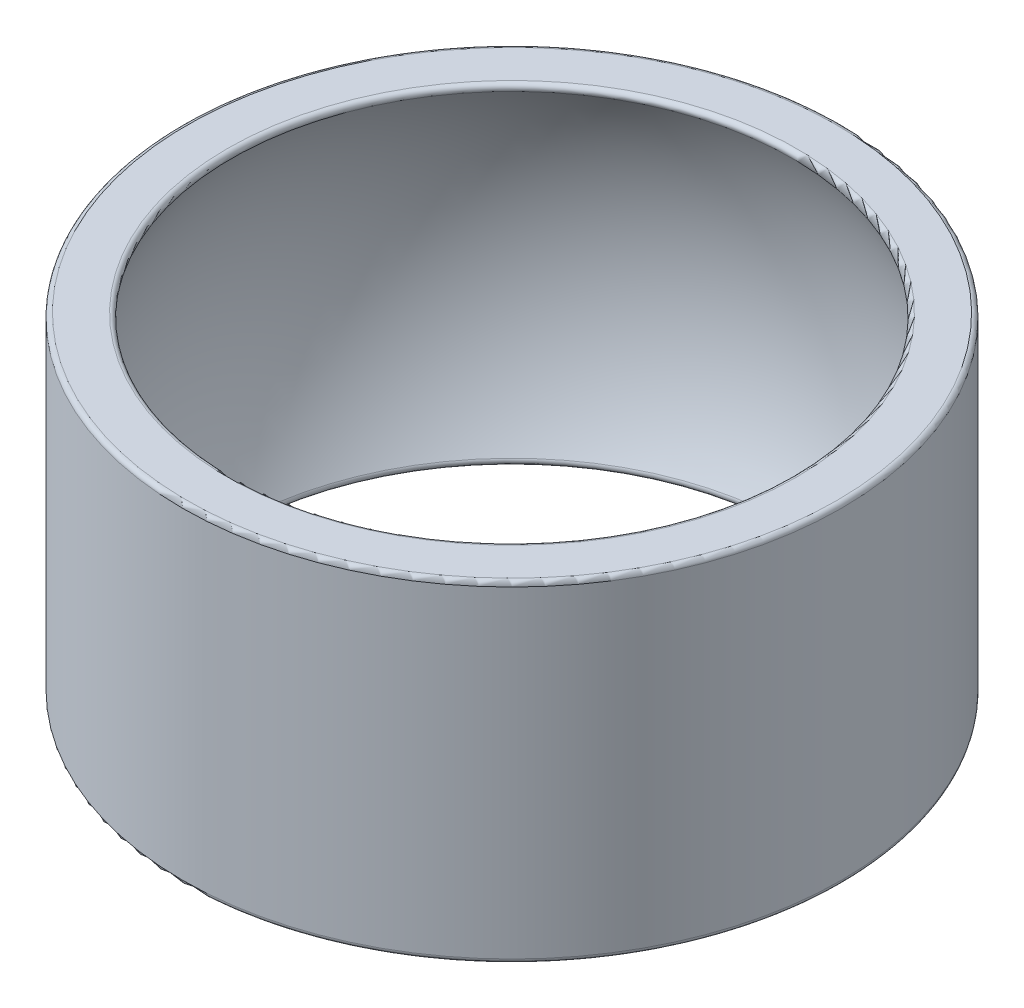
ISO-10303-21;
HEADER;
FILE_DESCRIPTION(('STEP AP214'),'2;1');
FILE_NAME('part.step','',(''),(''),'','','');
FILE_SCHEMA(('AUTOMOTIVE_DESIGN { 1 0 10303 214 1 1 1 1 }'));
ENDSEC;
DATA;
#1=APPLICATION_CONTEXT('core data for automotive mechanical design processes');
#2=APPLICATION_PROTOCOL_DEFINITION('international standard','automotive_design',2000,#1);
#3=PRODUCT_CONTEXT('',#1,'mechanical');
#4=PRODUCT('Part','Part','',(#3));
#5=PRODUCT_RELATED_PRODUCT_CATEGORY('part','',(#4));
#6=PRODUCT_DEFINITION_FORMATION('','',#4);
#7=PRODUCT_DEFINITION_CONTEXT('part definition',#1,'design');
#8=PRODUCT_DEFINITION('design','',#6,#7);
#9=PRODUCT_DEFINITION_SHAPE('','',#8);
#10=(LENGTH_UNIT() NAMED_UNIT(*) SI_UNIT(.MILLI.,.METRE.));
#11=(NAMED_UNIT(*) PLANE_ANGLE_UNIT() SI_UNIT($,.RADIAN.));
#12=(NAMED_UNIT(*) SI_UNIT($,.STERADIAN.) SOLID_ANGLE_UNIT());
#13=UNCERTAINTY_MEASURE_WITH_UNIT(LENGTH_MEASURE(1.E-05),#10,'distance_accuracy_value','');
#14=(GEOMETRIC_REPRESENTATION_CONTEXT(3) GLOBAL_UNCERTAINTY_ASSIGNED_CONTEXT((#13)) GLOBAL_UNIT_ASSIGNED_CONTEXT((#10,
#11,#12)) REPRESENTATION_CONTEXT('',''));
#15=CARTESIAN_POINT('',(0.,0.,0.));
#16=DIRECTION('',(0.,0.,1.));
#17=DIRECTION('',(1.,0.,0.));
#18=AXIS2_PLACEMENT_3D('',#15,#16,#17);
#19=CARTESIAN_POINT('',(0.,11.,0.));
#20=DIRECTION('',(0.,1.,0.));
#21=DIRECTION('',(-1.,0.,0.));
#22=AXIS2_PLACEMENT_3D('',#19,#20,#21);
#23=CYLINDRICAL_SURFACE('',#22,21.8917792789896);
#24=CARTESIAN_POINT('',(0.,-10.7,0.));
#25=DIRECTION('',(0.,1.,0.));
#26=DIRECTION('',(-1.,0.,0.));
#27=AXIS2_PLACEMENT_3D('',#24,#25,#26);
#28=CIRCLE('',#27,21.8917792789896);
#29=CARTESIAN_POINT('',(-21.8917792789896,-10.7,0.));
#30=VERTEX_POINT('',#29);
#31=EDGE_CURVE('E10',#30,#30,#28,.T.);
#32=ORIENTED_EDGE('',*,*,#31,.T.);
#33=EDGE_LOOP('',(#32));
#34=FACE_BOUND('',#33,.T.);
#35=CARTESIAN_POINT('',(0.,10.7,0.));
#36=DIRECTION('',(0.,-1.,0.));
#37=DIRECTION('',(1.,0.,0.));
#38=AXIS2_PLACEMENT_3D('',#35,#36,#37);
#39=CIRCLE('',#38,21.8917792789896);
#40=CARTESIAN_POINT('',(21.8917792789896,10.7,0.));
#41=VERTEX_POINT('',#40);
#42=EDGE_CURVE('E39',#41,#41,#39,.T.);
#43=ORIENTED_EDGE('',*,*,#42,.T.);
#44=EDGE_LOOP('',(#43));
#45=FACE_BOUND('',#44,.T.);
#46=ADVANCED_FACE('F32',(#34,#45),#23,.T.);
#47=CARTESIAN_POINT('',(18.3856091821838,11.,0.));
#48=DIRECTION('',(0.,-1.,0.));
#49=DIRECTION('',(1.,0.,0.));
#50=AXIS2_PLACEMENT_3D('',#47,#48,#49);
#51=PLANE('',#50);
#52=CARTESIAN_POINT('',(0.,11.,0.));
#53=DIRECTION('',(0.,-1.,0.));
#54=DIRECTION('',(1.,0.,0.));
#55=AXIS2_PLACEMENT_3D('',#52,#53,#54);
#56=CIRCLE('',#55,18.9072902606376);
#57=CARTESIAN_POINT('',(18.9072902606376,11.,0.));
#58=VERTEX_POINT('',#57);
#59=EDGE_CURVE('E52',#58,#58,#56,.T.);
#60=ORIENTED_EDGE('',*,*,#59,.T.);
#61=EDGE_LOOP('',(#60));
#62=FACE_BOUND('',#61,.T.);
#63=CARTESIAN_POINT('',(0.,11.,0.));
#64=DIRECTION('',(0.,-1.,0.));
#65=DIRECTION('',(1.,0.,0.));
#66=AXIS2_PLACEMENT_3D('',#63,#64,#65);
#67=CIRCLE('',#66,21.5917792789896);
#68=CARTESIAN_POINT('',(21.5917792789896,11.,0.));
#69=VERTEX_POINT('',#68);
#70=EDGE_CURVE('E55',#69,#69,#67,.F.);
#71=ORIENTED_EDGE('',*,*,#70,.T.);
#72=EDGE_LOOP('',(#71));
#73=FACE_BOUND('',#72,.T.);
#74=ADVANCED_FACE('F88',(#62,#73),#51,.F.);
#75=CARTESIAN_POINT('',(0.,0.,0.));
#76=DIRECTION('',(0.,1.,0.));
#77=DIRECTION('',(1.,0.,0.));
#78=AXIS2_PLACEMENT_3D('',#75,#76,#77);
#79=SPHERICAL_SURFACE('',#78,21.425);
#80=CARTESIAN_POINT('',(0.,10.5522439585731,0.));
#81=DIRECTION('',(0.,-1.,0.));
#82=DIRECTION('',(1.,0.,0.));
#83=AXIS2_PLACEMENT_3D('',#80,#81,#82);
#84=CIRCLE('',#83,18.6461999463365);
#85=CARTESIAN_POINT('',(18.6461999463365,10.5522439585731,0.));
#86=VERTEX_POINT('',#85);
#87=EDGE_CURVE('E58',#86,#86,#84,.F.);
#88=ORIENTED_EDGE('',*,*,#87,.T.);
#89=EDGE_LOOP('',(#88));
#90=FACE_BOUND('',#89,.T.);
#91=CARTESIAN_POINT('',(0.,-10.5522439585731,0.));
#92=DIRECTION('',(0.,1.,0.));
#93=DIRECTION('',(-1.,0.,0.));
#94=AXIS2_PLACEMENT_3D('',#91,#92,#93);
#95=CIRCLE('',#94,18.6461999463365);
#96=CARTESIAN_POINT('',(-18.6461999463365,-10.5522439585731,0.));
#97=VERTEX_POINT('',#96);
#98=EDGE_CURVE('E61',#97,#97,#95,.F.);
#99=ORIENTED_EDGE('',*,*,#98,.T.);
#100=EDGE_LOOP('',(#99));
#101=FACE_BOUND('',#100,.T.);
#102=ADVANCED_FACE('F65',(#90,#101),#79,.F.);
#103=CARTESIAN_POINT('',(18.3856091821838,-11.,0.));
#104=DIRECTION('',(0.,1.,0.));
#105=DIRECTION('',(-1.,0.,0.));
#106=AXIS2_PLACEMENT_3D('',#103,#104,#105);
#107=PLANE('',#106);
#108=CARTESIAN_POINT('',(0.,-11.,0.));
#109=DIRECTION('',(0.,1.,0.));
#110=DIRECTION('',(-1.,0.,0.));
#111=AXIS2_PLACEMENT_3D('',#108,#109,#110);
#112=CIRCLE('',#111,18.9072902606376);
#113=CARTESIAN_POINT('',(-18.9072902606376,-11.,0.));
#114=VERTEX_POINT('',#113);
#115=EDGE_CURVE('E43',#114,#114,#112,.T.);
#116=ORIENTED_EDGE('',*,*,#115,.T.);
#117=EDGE_LOOP('',(#116));
#118=FACE_BOUND('',#117,.T.);
#119=CARTESIAN_POINT('',(0.,-11.,0.));
#120=DIRECTION('',(0.,1.,0.));
#121=DIRECTION('',(-1.,0.,0.));
#122=AXIS2_PLACEMENT_3D('',#119,#120,#121);
#123=CIRCLE('',#122,21.5917792789896);
#124=CARTESIAN_POINT('',(-21.5917792789896,-11.,0.));
#125=VERTEX_POINT('',#124);
#126=EDGE_CURVE('E47',#125,#125,#123,.F.);
#127=ORIENTED_EDGE('',*,*,#126,.T.);
#128=EDGE_LOOP('',(#127));
#129=FACE_BOUND('',#128,.T.);
#130=ADVANCED_FACE('F75',(#118,#129),#107,.F.);
#131=CARTESIAN_POINT('',(0.,10.7,0.));
#132=DIRECTION('',(0.,-1.,0.));
#133=DIRECTION('',(1.,0.,0.));
#134=AXIS2_PLACEMENT_3D('',#131,#132,#133);
#135=TOROIDAL_SURFACE('',#134,18.9072902606376,0.3);
#136=ORIENTED_EDGE('',*,*,#59,.F.);
#137=EDGE_LOOP('',(#136));
#138=FACE_BOUND('',#137,.T.);
#139=ORIENTED_EDGE('',*,*,#87,.F.);
#140=EDGE_LOOP('',(#139));
#141=FACE_BOUND('',#140,.T.);
#142=ADVANCED_FACE('F71',(#138,#141),#135,.T.);
#143=CARTESIAN_POINT('',(0.,-10.7,0.));
#144=DIRECTION('',(0.,1.,0.));
#145=DIRECTION('',(-1.,0.,0.));
#146=AXIS2_PLACEMENT_3D('',#143,#144,#145);
#147=TOROIDAL_SURFACE('',#146,18.9072902606376,0.3);
#148=ORIENTED_EDGE('',*,*,#98,.F.);
#149=EDGE_LOOP('',(#148));
#150=FACE_BOUND('',#149,.T.);
#151=ORIENTED_EDGE('',*,*,#115,.F.);
#152=EDGE_LOOP('',(#151));
#153=FACE_BOUND('',#152,.T.);
#154=ADVANCED_FACE('F67',(#150,#153),#147,.T.);
#155=CARTESIAN_POINT('',(0.,-10.7,0.));
#156=DIRECTION('',(0.,1.,0.));
#157=DIRECTION('',(-1.,0.,0.));
#158=AXIS2_PLACEMENT_3D('',#155,#156,#157);
#159=TOROIDAL_SURFACE('',#158,21.5917792789896,0.3);
#160=ORIENTED_EDGE('',*,*,#126,.F.);
#161=EDGE_LOOP('',(#160));
#162=FACE_BOUND('',#161,.T.);
#163=ORIENTED_EDGE('',*,*,#31,.F.);
#164=EDGE_LOOP('',(#163));
#165=FACE_BOUND('',#164,.T.);
#166=ADVANCED_FACE('F70',(#162,#165),#159,.T.);
#167=CARTESIAN_POINT('',(0.,10.7,0.));
#168=DIRECTION('',(0.,-1.,0.));
#169=DIRECTION('',(1.,0.,0.));
#170=AXIS2_PLACEMENT_3D('',#167,#168,#169);
#171=TOROIDAL_SURFACE('',#170,21.5917792789896,0.3);
#172=ORIENTED_EDGE('',*,*,#42,.F.);
#173=EDGE_LOOP('',(#172));
#174=FACE_BOUND('',#173,.T.);
#175=ORIENTED_EDGE('',*,*,#70,.F.);
#176=EDGE_LOOP('',(#175));
#177=FACE_BOUND('',#176,.T.);
#178=ADVANCED_FACE('F34',(#174,#177),#171,.T.);
#179=CLOSED_SHELL('',(#46,#74,#102,#130,#142,#154,#166,#178));
#180=MANIFOLD_SOLID_BREP('B2',#179);
#181=ADVANCED_BREP_SHAPE_REPRESENTATION('',(#18,#180),#14);
#182=SHAPE_DEFINITION_REPRESENTATION(#9,#181);
ENDSEC;
END-ISO-10303-21;
